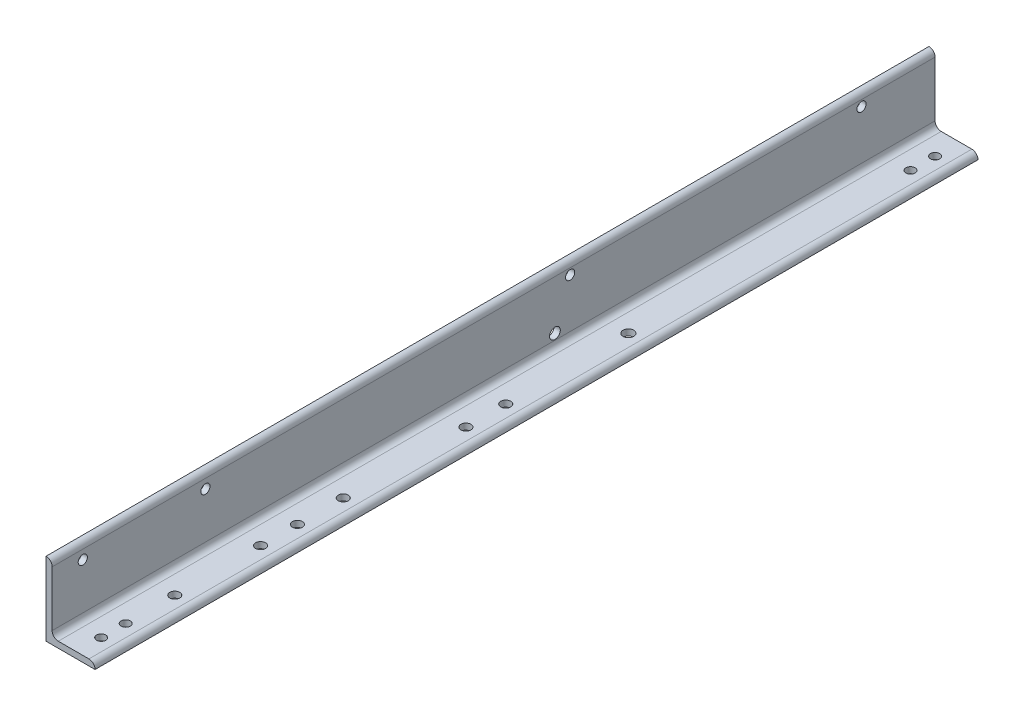
ISO-10303-21;
HEADER;
FILE_DESCRIPTION(('STEP AP214'),'2;1');
FILE_NAME('part.step','',(''),(''),'','','');
FILE_SCHEMA(('AUTOMOTIVE_DESIGN { 1 0 10303 214 1 1 1 1 }'));
ENDSEC;
DATA;
#1=APPLICATION_CONTEXT('core data for automotive mechanical design processes');
#2=APPLICATION_PROTOCOL_DEFINITION('international standard','automotive_design',2000,#1);
#3=PRODUCT_CONTEXT('',#1,'mechanical');
#4=PRODUCT('Part','Part','',(#3));
#5=PRODUCT_RELATED_PRODUCT_CATEGORY('part','',(#4));
#6=PRODUCT_DEFINITION_FORMATION('','',#4);
#7=PRODUCT_DEFINITION_CONTEXT('part definition',#1,'design');
#8=PRODUCT_DEFINITION('design','',#6,#7);
#9=PRODUCT_DEFINITION_SHAPE('','',#8);
#10=(LENGTH_UNIT() NAMED_UNIT(*) SI_UNIT(.MILLI.,.METRE.));
#11=(NAMED_UNIT(*) PLANE_ANGLE_UNIT() SI_UNIT($,.RADIAN.));
#12=(NAMED_UNIT(*) SI_UNIT($,.STERADIAN.) SOLID_ANGLE_UNIT());
#13=UNCERTAINTY_MEASURE_WITH_UNIT(LENGTH_MEASURE(1.E-05),#10,'distance_accuracy_value','');
#14=(GEOMETRIC_REPRESENTATION_CONTEXT(3) GLOBAL_UNCERTAINTY_ASSIGNED_CONTEXT((#13)) GLOBAL_UNIT_ASSIGNED_CONTEXT((#10,
#11,#12)) REPRESENTATION_CONTEXT('',''));
#15=CARTESIAN_POINT('',(0.,0.,0.));
#16=DIRECTION('',(0.,0.,1.));
#17=DIRECTION('',(1.,0.,0.));
#18=AXIS2_PLACEMENT_3D('',#15,#16,#17);
#19=CARTESIAN_POINT('',(101.6,0.,914.4));
#20=DIRECTION('',(0.,1.,0.));
#21=DIRECTION('',(-1.,0.,0.));
#22=AXIS2_PLACEMENT_3D('',#19,#20,#21);
#23=PLANE('',#22);
#24=CARTESIAN_POINT('',(63.5,0.,812.8));
#25=DIRECTION('',(0.,1.,0.));
#26=DIRECTION('',(-1.,0.,0.));
#27=AXIS2_PLACEMENT_3D('',#24,#25,#26);
#28=CIRCLE('',#27,9.525);
#29=CARTESIAN_POINT('',(53.975,0.,812.8));
#30=VERTEX_POINT('',#29);
#31=EDGE_CURVE('E253',#30,#30,#28,.F.);
#32=ORIENTED_EDGE('',*,*,#31,.F.);
#33=EDGE_LOOP('',(#32));
#34=FACE_BOUND('',#33,.T.);
#35=CARTESIAN_POINT('',(63.5,0.,-812.8));
#36=DIRECTION('',(0.,1.,0.));
#37=DIRECTION('',(-1.,0.,0.));
#38=AXIS2_PLACEMENT_3D('',#35,#36,#37);
#39=CIRCLE('',#38,9.525);
#40=CARTESIAN_POINT('',(53.975,0.,-812.8));
#41=VERTEX_POINT('',#40);
#42=EDGE_CURVE('E247',#41,#41,#39,.F.);
#43=ORIENTED_EDGE('',*,*,#42,.F.);
#44=EDGE_LOOP('',(#43));
#45=FACE_BOUND('',#44,.T.);
#46=CARTESIAN_POINT('',(63.5,0.,362.204));
#47=DIRECTION('',(0.,1.,0.));
#48=DIRECTION('',(-1.,0.,0.));
#49=AXIS2_PLACEMENT_3D('',#46,#47,#48);
#50=CIRCLE('',#49,10.31875);
#51=CARTESIAN_POINT('',(53.18125,0.,362.204));
#52=VERTEX_POINT('',#51);
#53=EDGE_CURVE('E241',#52,#52,#50,.F.);
#54=ORIENTED_EDGE('',*,*,#53,.F.);
#55=EDGE_LOOP('',(#54));
#56=FACE_BOUND('',#55,.T.);
#57=CARTESIAN_POINT('',(63.5,0.,-228.346));
#58=DIRECTION('',(0.,1.,0.));
#59=DIRECTION('',(-1.,0.,0.));
#60=AXIS2_PLACEMENT_3D('',#57,#58,#59);
#61=CIRCLE('',#60,11.1125);
#62=CARTESIAN_POINT('',(52.3875,0.,-228.346));
#63=VERTEX_POINT('',#62);
#64=EDGE_CURVE('E235',#63,#63,#61,.F.);
#65=ORIENTED_EDGE('',*,*,#64,.F.);
#66=EDGE_LOOP('',(#65));
#67=FACE_BOUND('',#66,.T.);
#68=CARTESIAN_POINT('',(63.5,0.,25.654));
#69=DIRECTION('',(0.,1.,0.));
#70=DIRECTION('',(-1.,0.,0.));
#71=AXIS2_PLACEMENT_3D('',#68,#69,#70);
#72=CIRCLE('',#71,10.31875);
#73=CARTESIAN_POINT('',(53.18125,0.,25.654));
#74=VERTEX_POINT('',#73);
#75=EDGE_CURVE('E229',#74,#74,#72,.F.);
#76=ORIENTED_EDGE('',*,*,#75,.F.);
#77=EDGE_LOOP('',(#76));
#78=FACE_BOUND('',#77,.T.);
#79=CARTESIAN_POINT('',(63.5,0.,533.4));
#80=DIRECTION('',(0.,1.,0.));
#81=DIRECTION('',(-1.,0.,0.));
#82=AXIS2_PLACEMENT_3D('',#79,#80,#81);
#83=CIRCLE('',#82,10.31875);
#84=CARTESIAN_POINT('',(53.18125,0.,533.4));
#85=VERTEX_POINT('',#84);
#86=EDGE_CURVE('E223',#85,#85,#83,.F.);
#87=ORIENTED_EDGE('',*,*,#86,.F.);
#88=EDGE_LOOP('',(#87));
#89=FACE_BOUND('',#88,.T.);
#90=CARTESIAN_POINT('',(63.5,0.,108.204));
#91=DIRECTION('',(0.,1.,0.));
#92=DIRECTION('',(-1.,0.,0.));
#93=AXIS2_PLACEMENT_3D('',#90,#91,#92);
#94=CIRCLE('',#93,10.31875);
#95=CARTESIAN_POINT('',(53.18125,0.,108.204));
#96=VERTEX_POINT('',#95);
#97=EDGE_CURVE('E217',#96,#96,#94,.F.);
#98=ORIENTED_EDGE('',*,*,#97,.F.);
#99=EDGE_LOOP('',(#98));
#100=FACE_BOUND('',#99,.T.);
#101=CARTESIAN_POINT('',(63.5,0.,457.2));
#102=DIRECTION('',(0.,1.,0.));
#103=DIRECTION('',(-1.,0.,0.));
#104=AXIS2_PLACEMENT_3D('',#101,#102,#103);
#105=CIRCLE('',#104,10.31875);
#106=CARTESIAN_POINT('',(53.18125,0.,457.2));
#107=VERTEX_POINT('',#106);
#108=EDGE_CURVE('E211',#107,#107,#105,.F.);
#109=ORIENTED_EDGE('',*,*,#108,.F.);
#110=EDGE_LOOP('',(#109));
#111=FACE_BOUND('',#110,.T.);
#112=CARTESIAN_POINT('',(63.5,0.,711.2));
#113=DIRECTION('',(0.,1.,0.));
#114=DIRECTION('',(-1.,0.,0.));
#115=AXIS2_PLACEMENT_3D('',#112,#113,#114);
#116=CIRCLE('',#115,10.31875);
#117=CARTESIAN_POINT('',(53.18125,0.,711.2));
#118=VERTEX_POINT('',#117);
#119=EDGE_CURVE('E205',#118,#118,#116,.F.);
#120=ORIENTED_EDGE('',*,*,#119,.F.);
#121=EDGE_LOOP('',(#120));
#122=FACE_BOUND('',#121,.T.);
#123=CARTESIAN_POINT('',(63.5,0.,-863.6));
#124=DIRECTION('',(0.,1.,0.));
#125=DIRECTION('',(-1.,0.,0.));
#126=AXIS2_PLACEMENT_3D('',#123,#124,#125);
#127=CIRCLE('',#126,9.525);
#128=CARTESIAN_POINT('',(53.975,0.,-863.6));
#129=VERTEX_POINT('',#128);
#130=EDGE_CURVE('E199',#129,#129,#127,.F.);
#131=ORIENTED_EDGE('',*,*,#130,.F.);
#132=EDGE_LOOP('',(#131));
#133=FACE_BOUND('',#132,.T.);
#134=CARTESIAN_POINT('',(63.5,0.,863.6));
#135=DIRECTION('',(0.,1.,0.));
#136=DIRECTION('',(-1.,0.,0.));
#137=AXIS2_PLACEMENT_3D('',#134,#135,#136);
#138=CIRCLE('',#137,9.525);
#139=CARTESIAN_POINT('',(53.975,0.,863.6));
#140=VERTEX_POINT('',#139);
#141=EDGE_CURVE('E140',#140,#140,#138,.F.);
#142=ORIENTED_EDGE('',*,*,#141,.F.);
#143=EDGE_LOOP('',(#142));
#144=FACE_BOUND('',#143,.T.);
#145=DIRECTION('',(1.,0.,0.));
#146=VECTOR('',#145,1.);
#147=CARTESIAN_POINT('',(101.6,0.,-914.4));
#148=LINE('',#147,#146);
#149=CARTESIAN_POINT('',(0.,0.,-914.4));
#150=VERTEX_POINT('',#149);
#151=CARTESIAN_POINT('',(101.6,0.,-914.4));
#152=VERTEX_POINT('',#151);
#153=EDGE_CURVE('E136',#150,#152,#148,.T.);
#154=ORIENTED_EDGE('',*,*,#153,.T.);
#155=DIRECTION('',(0.,0.,-1.));
#156=VECTOR('',#155,1.);
#157=CARTESIAN_POINT('',(101.6,0.,914.4));
#158=LINE('',#157,#156);
#159=CARTESIAN_POINT('',(101.6,0.,914.4));
#160=VERTEX_POINT('',#159);
#161=EDGE_CURVE('E11',#160,#152,#158,.T.);
#162=ORIENTED_EDGE('',*,*,#161,.F.);
#163=DIRECTION('',(1.,0.,0.));
#164=VECTOR('',#163,1.);
#165=CARTESIAN_POINT('',(101.6,0.,914.4));
#166=LINE('',#165,#164);
#167=CARTESIAN_POINT('',(0.,0.,914.4));
#168=VERTEX_POINT('',#167);
#169=EDGE_CURVE('E153',#168,#160,#166,.T.);
#170=ORIENTED_EDGE('',*,*,#169,.F.);
#171=DIRECTION('',(0.,0.,-1.));
#172=VECTOR('',#171,1.);
#173=CARTESIAN_POINT('',(0.,0.,914.4));
#174=LINE('',#173,#172);
#175=EDGE_CURVE('E132',#168,#150,#174,.T.);
#176=ORIENTED_EDGE('',*,*,#175,.T.);
#177=EDGE_LOOP('',(#154,#162,#170,#176));
#178=FACE_BOUND('',#177,.T.);
#179=ADVANCED_FACE('F34',(#34,#45,#56,#67,#78,#89,#100,#111,#122,#133,#144,#178),#23,.F.);
#180=CARTESIAN_POINT('',(101.6,0.00508000000000453,914.4));
#181=DIRECTION('',(-1.,0.,0.));
#182=DIRECTION('',(0.,0.,1.));
#183=AXIS2_PLACEMENT_3D('',#180,#181,#182);
#184=PLANE('',#183);
#185=DIRECTION('',(0.,1.,0.));
#186=VECTOR('',#185,1.);
#187=CARTESIAN_POINT('',(101.6,0.00508000000000453,-914.4));
#188=LINE('',#187,#186);
#189=CARTESIAN_POINT('',(101.6,0.00508000000000453,-914.4));
#190=VERTEX_POINT('',#189);
#191=EDGE_CURVE('E139',#152,#190,#188,.T.);
#192=ORIENTED_EDGE('',*,*,#191,.T.);
#193=DIRECTION('',(0.,0.,-1.));
#194=VECTOR('',#193,1.);
#195=CARTESIAN_POINT('',(101.6,0.00508000000000453,914.4));
#196=LINE('',#195,#194);
#197=CARTESIAN_POINT('',(101.6,0.00508000000000453,914.4));
#198=VERTEX_POINT('',#197);
#199=EDGE_CURVE('E42',#198,#190,#196,.T.);
#200=ORIENTED_EDGE('',*,*,#199,.F.);
#201=DIRECTION('',(0.,1.,0.));
#202=VECTOR('',#201,1.);
#203=CARTESIAN_POINT('',(101.6,0.00508000000000453,914.4));
#204=LINE('',#203,#202);
#205=EDGE_CURVE('E96',#160,#198,#204,.T.);
#206=ORIENTED_EDGE('',*,*,#205,.F.);
#207=ORIENTED_EDGE('',*,*,#161,.T.);
#208=EDGE_LOOP('',(#192,#200,#206,#207));
#209=FACE_BOUND('',#208,.T.);
#210=ADVANCED_FACE('F322',(#209),#184,.F.);
#211=CARTESIAN_POINT('',(88.90508,0.00508000000000453,914.4));
#212=DIRECTION('',(0.,0.,-1.));
#213=DIRECTION('',(-1.,0.,0.));
#214=AXIS2_PLACEMENT_3D('',#211,#212,#213);
#215=CYLINDRICAL_SURFACE('',#214,12.69492);
#216=CARTESIAN_POINT('',(88.90508,0.00508000000000453,-914.4));
#217=DIRECTION('',(0.,0.,1.));
#218=DIRECTION('',(1.,0.,0.));
#219=AXIS2_PLACEMENT_3D('',#216,#217,#218);
#220=CIRCLE('',#219,12.69492);
#221=CARTESIAN_POINT('',(88.90508,12.7,-914.4));
#222=VERTEX_POINT('',#221);
#223=EDGE_CURVE('E142',#190,#222,#220,.T.);
#224=ORIENTED_EDGE('',*,*,#223,.T.);
#225=DIRECTION('',(0.,0.,-1.));
#226=VECTOR('',#225,1.);
#227=CARTESIAN_POINT('',(88.90508,12.7,914.4));
#228=LINE('',#227,#226);
#229=CARTESIAN_POINT('',(88.90508,12.7,914.4));
#230=VERTEX_POINT('',#229);
#231=EDGE_CURVE('E163',#230,#222,#228,.T.);
#232=ORIENTED_EDGE('',*,*,#231,.F.);
#233=CARTESIAN_POINT('',(88.90508,0.00508000000000453,914.4));
#234=DIRECTION('',(0.,0.,1.));
#235=DIRECTION('',(1.,0.,0.));
#236=AXIS2_PLACEMENT_3D('',#233,#234,#235);
#237=CIRCLE('',#236,12.69492);
#238=EDGE_CURVE('E171',#198,#230,#237,.T.);
#239=ORIENTED_EDGE('',*,*,#238,.F.);
#240=ORIENTED_EDGE('',*,*,#199,.T.);
#241=EDGE_LOOP('',(#224,#232,#239,#240));
#242=FACE_BOUND('',#241,.T.);
#243=ADVANCED_FACE('F169',(#242),#215,.T.);
#244=CARTESIAN_POINT('',(25.4,12.7,914.4));
#245=DIRECTION('',(0.,-1.,0.));
#246=DIRECTION('',(0.,0.,-1.));
#247=AXIS2_PLACEMENT_3D('',#244,#245,#246);
#248=PLANE('',#247);
#249=CARTESIAN_POINT('',(63.5,12.7,812.8));
#250=DIRECTION('',(0.,1.,0.));
#251=DIRECTION('',(-1.,0.,0.));
#252=AXIS2_PLACEMENT_3D('',#249,#250,#251);
#253=CIRCLE('',#252,9.525);
#254=CARTESIAN_POINT('',(53.975,12.7,812.8));
#255=VERTEX_POINT('',#254);
#256=EDGE_CURVE('E256',#255,#255,#253,.T.);
#257=ORIENTED_EDGE('',*,*,#256,.F.);
#258=EDGE_LOOP('',(#257));
#259=FACE_BOUND('',#258,.T.);
#260=CARTESIAN_POINT('',(63.5,12.7,-812.8));
#261=DIRECTION('',(0.,1.,0.));
#262=DIRECTION('',(-1.,0.,0.));
#263=AXIS2_PLACEMENT_3D('',#260,#261,#262);
#264=CIRCLE('',#263,9.525);
#265=CARTESIAN_POINT('',(53.975,12.7,-812.8));
#266=VERTEX_POINT('',#265);
#267=EDGE_CURVE('E250',#266,#266,#264,.T.);
#268=ORIENTED_EDGE('',*,*,#267,.F.);
#269=EDGE_LOOP('',(#268));
#270=FACE_BOUND('',#269,.T.);
#271=CARTESIAN_POINT('',(63.5,12.7,362.204));
#272=DIRECTION('',(0.,1.,0.));
#273=DIRECTION('',(-1.,0.,0.));
#274=AXIS2_PLACEMENT_3D('',#271,#272,#273);
#275=CIRCLE('',#274,10.31875);
#276=CARTESIAN_POINT('',(53.18125,12.7,362.204));
#277=VERTEX_POINT('',#276);
#278=EDGE_CURVE('E244',#277,#277,#275,.T.);
#279=ORIENTED_EDGE('',*,*,#278,.F.);
#280=EDGE_LOOP('',(#279));
#281=FACE_BOUND('',#280,.T.);
#282=CARTESIAN_POINT('',(63.5,12.7,-228.346));
#283=DIRECTION('',(0.,1.,0.));
#284=DIRECTION('',(-1.,0.,0.));
#285=AXIS2_PLACEMENT_3D('',#282,#283,#284);
#286=CIRCLE('',#285,11.1125);
#287=CARTESIAN_POINT('',(52.3875,12.7,-228.346));
#288=VERTEX_POINT('',#287);
#289=EDGE_CURVE('E238',#288,#288,#286,.T.);
#290=ORIENTED_EDGE('',*,*,#289,.F.);
#291=EDGE_LOOP('',(#290));
#292=FACE_BOUND('',#291,.T.);
#293=CARTESIAN_POINT('',(63.5,12.7,25.654));
#294=DIRECTION('',(0.,1.,0.));
#295=DIRECTION('',(-1.,0.,0.));
#296=AXIS2_PLACEMENT_3D('',#293,#294,#295);
#297=CIRCLE('',#296,10.31875);
#298=CARTESIAN_POINT('',(53.18125,12.7,25.654));
#299=VERTEX_POINT('',#298);
#300=EDGE_CURVE('E232',#299,#299,#297,.T.);
#301=ORIENTED_EDGE('',*,*,#300,.F.);
#302=EDGE_LOOP('',(#301));
#303=FACE_BOUND('',#302,.T.);
#304=CARTESIAN_POINT('',(63.5,12.7,533.4));
#305=DIRECTION('',(0.,1.,0.));
#306=DIRECTION('',(-1.,0.,0.));
#307=AXIS2_PLACEMENT_3D('',#304,#305,#306);
#308=CIRCLE('',#307,10.31875);
#309=CARTESIAN_POINT('',(53.18125,12.7,533.4));
#310=VERTEX_POINT('',#309);
#311=EDGE_CURVE('E226',#310,#310,#308,.T.);
#312=ORIENTED_EDGE('',*,*,#311,.F.);
#313=EDGE_LOOP('',(#312));
#314=FACE_BOUND('',#313,.T.);
#315=CARTESIAN_POINT('',(63.5,12.7,108.204));
#316=DIRECTION('',(0.,1.,0.));
#317=DIRECTION('',(-1.,0.,0.));
#318=AXIS2_PLACEMENT_3D('',#315,#316,#317);
#319=CIRCLE('',#318,10.31875);
#320=CARTESIAN_POINT('',(53.18125,12.7,108.204));
#321=VERTEX_POINT('',#320);
#322=EDGE_CURVE('E220',#321,#321,#319,.T.);
#323=ORIENTED_EDGE('',*,*,#322,.F.);
#324=EDGE_LOOP('',(#323));
#325=FACE_BOUND('',#324,.T.);
#326=CARTESIAN_POINT('',(63.5,12.7,457.2));
#327=DIRECTION('',(0.,1.,0.));
#328=DIRECTION('',(-1.,0.,0.));
#329=AXIS2_PLACEMENT_3D('',#326,#327,#328);
#330=CIRCLE('',#329,10.31875);
#331=CARTESIAN_POINT('',(53.18125,12.7,457.2));
#332=VERTEX_POINT('',#331);
#333=EDGE_CURVE('E214',#332,#332,#330,.T.);
#334=ORIENTED_EDGE('',*,*,#333,.F.);
#335=EDGE_LOOP('',(#334));
#336=FACE_BOUND('',#335,.T.);
#337=CARTESIAN_POINT('',(63.5,12.7,711.2));
#338=DIRECTION('',(0.,1.,0.));
#339=DIRECTION('',(-1.,0.,0.));
#340=AXIS2_PLACEMENT_3D('',#337,#338,#339);
#341=CIRCLE('',#340,10.31875);
#342=CARTESIAN_POINT('',(53.18125,12.7,711.2));
#343=VERTEX_POINT('',#342);
#344=EDGE_CURVE('E208',#343,#343,#341,.T.);
#345=ORIENTED_EDGE('',*,*,#344,.F.);
#346=EDGE_LOOP('',(#345));
#347=FACE_BOUND('',#346,.T.);
#348=CARTESIAN_POINT('',(63.5,12.7,-863.6));
#349=DIRECTION('',(0.,1.,0.));
#350=DIRECTION('',(-1.,0.,0.));
#351=AXIS2_PLACEMENT_3D('',#348,#349,#350);
#352=CIRCLE('',#351,9.525);
#353=CARTESIAN_POINT('',(53.975,12.7,-863.6));
#354=VERTEX_POINT('',#353);
#355=EDGE_CURVE('E202',#354,#354,#352,.T.);
#356=ORIENTED_EDGE('',*,*,#355,.F.);
#357=EDGE_LOOP('',(#356));
#358=FACE_BOUND('',#357,.T.);
#359=CARTESIAN_POINT('',(63.5,12.7,863.6));
#360=DIRECTION('',(0.,1.,0.));
#361=DIRECTION('',(-1.,0.,0.));
#362=AXIS2_PLACEMENT_3D('',#359,#360,#361);
#363=CIRCLE('',#362,9.525);
#364=CARTESIAN_POINT('',(53.975,12.7,863.6));
#365=VERTEX_POINT('',#364);
#366=EDGE_CURVE('E196',#365,#365,#363,.T.);
#367=ORIENTED_EDGE('',*,*,#366,.F.);
#368=EDGE_LOOP('',(#367));
#369=FACE_BOUND('',#368,.T.);
#370=DIRECTION('',(-1.,0.,0.));
#371=VECTOR('',#370,1.);
#372=CARTESIAN_POINT('',(25.4,12.7,-914.4));
#373=LINE('',#372,#371);
#374=CARTESIAN_POINT('',(25.4,12.7,-914.4));
#375=VERTEX_POINT('',#374);
#376=EDGE_CURVE('E144',#222,#375,#373,.T.);
#377=ORIENTED_EDGE('',*,*,#376,.T.);
#378=DIRECTION('',(0.,0.,-1.));
#379=VECTOR('',#378,1.);
#380=CARTESIAN_POINT('',(25.4,12.7,914.4));
#381=LINE('',#380,#379);
#382=CARTESIAN_POINT('',(25.4,12.7,914.4));
#383=VERTEX_POINT('',#382);
#384=EDGE_CURVE('E160',#383,#375,#381,.T.);
#385=ORIENTED_EDGE('',*,*,#384,.F.);
#386=DIRECTION('',(-1.,0.,0.));
#387=VECTOR('',#386,1.);
#388=CARTESIAN_POINT('',(25.4,12.7,914.4));
#389=LINE('',#388,#387);
#390=EDGE_CURVE('E187',#230,#383,#389,.T.);
#391=ORIENTED_EDGE('',*,*,#390,.F.);
#392=ORIENTED_EDGE('',*,*,#231,.T.);
#393=EDGE_LOOP('',(#377,#385,#391,#392));
#394=FACE_BOUND('',#393,.T.);
#395=ADVANCED_FACE('F180',(#259,#270,#281,#292,#303,#314,#325,#336,#347,#358,#369,#394),#248,.F.);
#396=CARTESIAN_POINT('',(25.4,25.4,914.4));
#397=DIRECTION('',(0.,0.,-1.));
#398=DIRECTION('',(-1.,0.,0.));
#399=AXIS2_PLACEMENT_3D('',#396,#397,#398);
#400=CYLINDRICAL_SURFACE('',#399,12.7);
#401=CARTESIAN_POINT('',(25.4,25.4,-914.4));
#402=DIRECTION('',(0.,0.,-1.));
#403=DIRECTION('',(-1.,0.,0.));
#404=AXIS2_PLACEMENT_3D('',#401,#402,#403);
#405=CIRCLE('',#404,12.7);
#406=CARTESIAN_POINT('',(12.7,25.4,-914.4));
#407=VERTEX_POINT('',#406);
#408=EDGE_CURVE('E146',#375,#407,#405,.T.);
#409=ORIENTED_EDGE('',*,*,#408,.T.);
#410=DIRECTION('',(0.,0.,-1.));
#411=VECTOR('',#410,1.);
#412=CARTESIAN_POINT('',(12.7,25.4,914.4));
#413=LINE('',#412,#411);
#414=CARTESIAN_POINT('',(12.7,25.4,914.4));
#415=VERTEX_POINT('',#414);
#416=EDGE_CURVE('E157',#415,#407,#413,.T.);
#417=ORIENTED_EDGE('',*,*,#416,.F.);
#418=CARTESIAN_POINT('',(25.4,25.4,914.4));
#419=DIRECTION('',(0.,0.,-1.));
#420=DIRECTION('',(-1.,0.,0.));
#421=AXIS2_PLACEMENT_3D('',#418,#419,#420);
#422=CIRCLE('',#421,12.7);
#423=EDGE_CURVE('E186',#383,#415,#422,.T.);
#424=ORIENTED_EDGE('',*,*,#423,.F.);
#425=ORIENTED_EDGE('',*,*,#384,.T.);
#426=EDGE_LOOP('',(#409,#417,#424,#425));
#427=FACE_BOUND('',#426,.T.);
#428=ADVANCED_FACE('F184',(#427),#400,.F.);
#429=CARTESIAN_POINT('',(12.7,139.70508,914.4));
#430=DIRECTION('',(-1.,0.,0.));
#431=DIRECTION('',(0.,-1.,0.));
#432=AXIS2_PLACEMENT_3D('',#429,#430,#431);
#433=PLANE('',#432);
#434=CARTESIAN_POINT('',(12.7,38.1,-127.));
#435=DIRECTION('',(-1.,0.,0.));
#436=DIRECTION('',(0.,-1.,0.));
#437=AXIS2_PLACEMENT_3D('',#434,#435,#436);
#438=CIRCLE('',#437,11.1125);
#439=CARTESIAN_POINT('',(12.7,26.9875,-127.));
#440=VERTEX_POINT('',#439);
#441=EDGE_CURVE('E283',#440,#440,#438,.T.);
#442=ORIENTED_EDGE('',*,*,#441,.T.);
#443=EDGE_LOOP('',(#442));
#444=FACE_BOUND('',#443,.T.);
#445=CARTESIAN_POINT('',(12.7,127.,-762.));
#446=DIRECTION('',(1.,0.,0.));
#447=DIRECTION('',(0.,1.,0.));
#448=AXIS2_PLACEMENT_3D('',#445,#446,#447);
#449=CIRCLE('',#448,9.52500000000002);
#450=CARTESIAN_POINT('',(12.7,136.525,-762.));
#451=VERTEX_POINT('',#450);
#452=EDGE_CURVE('E280',#451,#451,#449,.T.);
#453=ORIENTED_EDGE('',*,*,#452,.F.);
#454=EDGE_LOOP('',(#453));
#455=FACE_BOUND('',#454,.T.);
#456=CARTESIAN_POINT('',(12.7,127.,-158.496));
#457=DIRECTION('',(1.,0.,0.));
#458=DIRECTION('',(0.,1.,0.));
#459=AXIS2_PLACEMENT_3D('',#456,#457,#458);
#460=CIRCLE('',#459,9.52499999999999);
#461=CARTESIAN_POINT('',(12.7,136.525,-158.496));
#462=VERTEX_POINT('',#461);
#463=EDGE_CURVE('E274',#462,#462,#460,.T.);
#464=ORIENTED_EDGE('',*,*,#463,.F.);
#465=EDGE_LOOP('',(#464));
#466=FACE_BOUND('',#465,.T.);
#467=CARTESIAN_POINT('',(12.7,120.65,596.9));
#468=DIRECTION('',(1.,0.,0.));
#469=DIRECTION('',(0.,1.,0.));
#470=AXIS2_PLACEMENT_3D('',#467,#468,#469);
#471=CIRCLE('',#470,9.52500000000002);
#472=CARTESIAN_POINT('',(12.7,130.175,596.9));
#473=VERTEX_POINT('',#472);
#474=EDGE_CURVE('E268',#473,#473,#471,.T.);
#475=ORIENTED_EDGE('',*,*,#474,.F.);
#476=EDGE_LOOP('',(#475));
#477=FACE_BOUND('',#476,.T.);
#478=CARTESIAN_POINT('',(12.7,120.65,850.9));
#479=DIRECTION('',(1.,0.,0.));
#480=DIRECTION('',(0.,1.,0.));
#481=AXIS2_PLACEMENT_3D('',#478,#479,#480);
#482=CIRCLE('',#481,9.52500000000002);
#483=CARTESIAN_POINT('',(12.7,130.175,850.9));
#484=VERTEX_POINT('',#483);
#485=EDGE_CURVE('E262',#484,#484,#482,.T.);
#486=ORIENTED_EDGE('',*,*,#485,.F.);
#487=EDGE_LOOP('',(#486));
#488=FACE_BOUND('',#487,.T.);
#489=DIRECTION('',(0.,1.,0.));
#490=VECTOR('',#489,1.);
#491=CARTESIAN_POINT('',(12.7,139.70508,-914.4));
#492=LINE('',#491,#490);
#493=CARTESIAN_POINT('',(12.7,139.70508,-914.4));
#494=VERTEX_POINT('',#493);
#495=EDGE_CURVE('E148',#407,#494,#492,.T.);
#496=ORIENTED_EDGE('',*,*,#495,.T.);
#497=DIRECTION('',(0.,0.,-1.));
#498=VECTOR('',#497,1.);
#499=CARTESIAN_POINT('',(12.7,139.70508,914.4));
#500=LINE('',#499,#498);
#501=CARTESIAN_POINT('',(12.7,139.70508,914.4));
#502=VERTEX_POINT('',#501);
#503=EDGE_CURVE('E127',#502,#494,#500,.T.);
#504=ORIENTED_EDGE('',*,*,#503,.F.);
#505=DIRECTION('',(0.,1.,0.));
#506=VECTOR('',#505,1.);
#507=CARTESIAN_POINT('',(12.7,139.70508,914.4));
#508=LINE('',#507,#506);
#509=EDGE_CURVE('E118',#415,#502,#508,.T.);
#510=ORIENTED_EDGE('',*,*,#509,.F.);
#511=ORIENTED_EDGE('',*,*,#416,.T.);
#512=EDGE_LOOP('',(#496,#504,#510,#511));
#513=FACE_BOUND('',#512,.T.);
#514=ADVANCED_FACE('F352',(#444,#455,#466,#477,#488,#513),#433,.F.);
#515=CARTESIAN_POINT('',(0.00508000000000078,139.70508,914.4));
#516=DIRECTION('',(0.,0.,-1.));
#517=DIRECTION('',(-1.,0.,0.));
#518=AXIS2_PLACEMENT_3D('',#515,#516,#517);
#519=CYLINDRICAL_SURFACE('',#518,12.69492);
#520=CARTESIAN_POINT('',(0.00508000000000078,139.70508,-914.4));
#521=DIRECTION('',(0.,0.,1.));
#522=DIRECTION('',(-1.,0.,0.));
#523=AXIS2_PLACEMENT_3D('',#520,#521,#522);
#524=CIRCLE('',#523,12.69492);
#525=CARTESIAN_POINT('',(0.00508,152.4,-914.4));
#526=VERTEX_POINT('',#525);
#527=EDGE_CURVE('E126',#494,#526,#524,.T.);
#528=ORIENTED_EDGE('',*,*,#527,.T.);
#529=DIRECTION('',(0.,0.,-1.));
#530=VECTOR('',#529,1.);
#531=CARTESIAN_POINT('',(0.00508,152.4,914.4));
#532=LINE('',#531,#530);
#533=CARTESIAN_POINT('',(0.00508,152.4,914.4));
#534=VERTEX_POINT('',#533);
#535=EDGE_CURVE('E123',#534,#526,#532,.T.);
#536=ORIENTED_EDGE('',*,*,#535,.F.);
#537=CARTESIAN_POINT('',(0.00508000000000078,139.70508,914.4));
#538=DIRECTION('',(0.,0.,1.));
#539=DIRECTION('',(-1.,0.,0.));
#540=AXIS2_PLACEMENT_3D('',#537,#538,#539);
#541=CIRCLE('',#540,12.69492);
#542=EDGE_CURVE('E112',#502,#534,#541,.T.);
#543=ORIENTED_EDGE('',*,*,#542,.F.);
#544=ORIENTED_EDGE('',*,*,#503,.T.);
#545=EDGE_LOOP('',(#528,#536,#543,#544));
#546=FACE_BOUND('',#545,.T.);
#547=ADVANCED_FACE('F124',(#546),#519,.T.);
#548=CARTESIAN_POINT('',(0.,152.4,914.4));
#549=DIRECTION('',(0.,-1.,0.));
#550=DIRECTION('',(0.,0.,-1.));
#551=AXIS2_PLACEMENT_3D('',#548,#549,#550);
#552=PLANE('',#551);
#553=DIRECTION('',(-1.,0.,0.));
#554=VECTOR('',#553,1.);
#555=CARTESIAN_POINT('',(0.,152.4,-914.4));
#556=LINE('',#555,#554);
#557=CARTESIAN_POINT('',(0.,152.4,-914.4));
#558=VERTEX_POINT('',#557);
#559=EDGE_CURVE('E82',#526,#558,#556,.T.);
#560=ORIENTED_EDGE('',*,*,#559,.T.);
#561=DIRECTION('',(0.,0.,-1.));
#562=VECTOR('',#561,1.);
#563=CARTESIAN_POINT('',(0.,152.4,914.4));
#564=LINE('',#563,#562);
#565=CARTESIAN_POINT('',(0.,152.4,914.4));
#566=VERTEX_POINT('',#565);
#567=EDGE_CURVE('E128',#566,#558,#564,.T.);
#568=ORIENTED_EDGE('',*,*,#567,.F.);
#569=DIRECTION('',(-1.,0.,0.));
#570=VECTOR('',#569,1.);
#571=CARTESIAN_POINT('',(0.,152.4,914.4));
#572=LINE('',#571,#570);
#573=EDGE_CURVE('E116',#534,#566,#572,.T.);
#574=ORIENTED_EDGE('',*,*,#573,.F.);
#575=ORIENTED_EDGE('',*,*,#535,.T.);
#576=EDGE_LOOP('',(#560,#568,#574,#575));
#577=FACE_BOUND('',#576,.T.);
#578=ADVANCED_FACE('F130',(#577),#552,.F.);
#579=CARTESIAN_POINT('',(0.,0.,914.4));
#580=DIRECTION('',(1.,0.,0.));
#581=DIRECTION('',(0.,0.,-1.));
#582=AXIS2_PLACEMENT_3D('',#579,#580,#581);
#583=PLANE('',#582);
#584=CARTESIAN_POINT('',(0.,38.1,-127.));
#585=DIRECTION('',(-1.,0.,0.));
#586=DIRECTION('',(0.,0.,1.));
#587=AXIS2_PLACEMENT_3D('',#584,#585,#586);
#588=CIRCLE('',#587,11.1125);
#589=CARTESIAN_POINT('',(0.,38.1,-115.8875));
#590=VERTEX_POINT('',#589);
#591=EDGE_CURVE('E286',#590,#590,#588,.T.);
#592=ORIENTED_EDGE('',*,*,#591,.F.);
#593=EDGE_LOOP('',(#592));
#594=FACE_BOUND('',#593,.T.);
#595=CARTESIAN_POINT('',(0.,127.,-762.));
#596=DIRECTION('',(1.,0.,0.));
#597=DIRECTION('',(0.,0.,-1.));
#598=AXIS2_PLACEMENT_3D('',#595,#596,#597);
#599=CIRCLE('',#598,9.52500000000002);
#600=CARTESIAN_POINT('',(0.,127.,-771.525));
#601=VERTEX_POINT('',#600);
#602=EDGE_CURVE('E277',#601,#601,#599,.F.);
#603=ORIENTED_EDGE('',*,*,#602,.F.);
#604=EDGE_LOOP('',(#603));
#605=FACE_BOUND('',#604,.T.);
#606=CARTESIAN_POINT('',(0.,127.,-158.496));
#607=DIRECTION('',(1.,0.,0.));
#608=DIRECTION('',(0.,0.,-1.));
#609=AXIS2_PLACEMENT_3D('',#606,#607,#608);
#610=CIRCLE('',#609,9.52499999999999);
#611=CARTESIAN_POINT('',(0.,127.,-168.021));
#612=VERTEX_POINT('',#611);
#613=EDGE_CURVE('E271',#612,#612,#610,.F.);
#614=ORIENTED_EDGE('',*,*,#613,.F.);
#615=EDGE_LOOP('',(#614));
#616=FACE_BOUND('',#615,.T.);
#617=CARTESIAN_POINT('',(0.,120.65,596.9));
#618=DIRECTION('',(1.,0.,0.));
#619=DIRECTION('',(0.,0.,-1.));
#620=AXIS2_PLACEMENT_3D('',#617,#618,#619);
#621=CIRCLE('',#620,9.52500000000002);
#622=CARTESIAN_POINT('',(0.,120.65,587.375));
#623=VERTEX_POINT('',#622);
#624=EDGE_CURVE('E265',#623,#623,#621,.F.);
#625=ORIENTED_EDGE('',*,*,#624,.F.);
#626=EDGE_LOOP('',(#625));
#627=FACE_BOUND('',#626,.T.);
#628=CARTESIAN_POINT('',(0.,120.65,850.9));
#629=DIRECTION('',(1.,0.,0.));
#630=DIRECTION('',(0.,0.,-1.));
#631=AXIS2_PLACEMENT_3D('',#628,#629,#630);
#632=CIRCLE('',#631,9.52500000000002);
#633=CARTESIAN_POINT('',(0.,120.65,841.375));
#634=VERTEX_POINT('',#633);
#635=EDGE_CURVE('E259',#634,#634,#632,.F.);
#636=ORIENTED_EDGE('',*,*,#635,.F.);
#637=EDGE_LOOP('',(#636));
#638=FACE_BOUND('',#637,.T.);
#639=DIRECTION('',(0.,-1.,0.));
#640=VECTOR('',#639,1.);
#641=CARTESIAN_POINT('',(0.,0.,-914.4));
#642=LINE('',#641,#640);
#643=EDGE_CURVE('E88',#558,#150,#642,.T.);
#644=ORIENTED_EDGE('',*,*,#643,.T.);
#645=ORIENTED_EDGE('',*,*,#175,.F.);
#646=DIRECTION('',(0.,-1.,0.));
#647=VECTOR('',#646,1.);
#648=CARTESIAN_POINT('',(0.,0.,914.4));
#649=LINE('',#648,#647);
#650=EDGE_CURVE('E50',#566,#168,#649,.T.);
#651=ORIENTED_EDGE('',*,*,#650,.F.);
#652=ORIENTED_EDGE('',*,*,#567,.T.);
#653=EDGE_LOOP('',(#644,#645,#651,#652));
#654=FACE_BOUND('',#653,.T.);
#655=ADVANCED_FACE('F293',(#594,#605,#616,#627,#638,#654),#583,.F.);
#656=CARTESIAN_POINT('',(0.00508000000000078,139.70508,914.4));
#657=DIRECTION('',(0.,0.,-1.));
#658=DIRECTION('',(-1.,0.,0.));
#659=AXIS2_PLACEMENT_3D('',#656,#657,#658);
#660=PLANE('',#659);
#661=ORIENTED_EDGE('',*,*,#169,.T.);
#662=ORIENTED_EDGE('',*,*,#205,.T.);
#663=ORIENTED_EDGE('',*,*,#238,.T.);
#664=ORIENTED_EDGE('',*,*,#390,.T.);
#665=ORIENTED_EDGE('',*,*,#423,.T.);
#666=ORIENTED_EDGE('',*,*,#509,.T.);
#667=ORIENTED_EDGE('',*,*,#542,.T.);
#668=ORIENTED_EDGE('',*,*,#573,.T.);
#669=ORIENTED_EDGE('',*,*,#650,.T.);
#670=EDGE_LOOP('',(#661,#662,#663,#664,#665,#666,#667,#668,#669));
#671=FACE_BOUND('',#670,.T.);
#672=ADVANCED_FACE('F114',(#671),#660,.F.);
#673=CARTESIAN_POINT('',(0.00508000000000078,139.70508,-914.4));
#674=DIRECTION('',(0.,0.,-1.));
#675=DIRECTION('',(-1.,0.,0.));
#676=AXIS2_PLACEMENT_3D('',#673,#674,#675);
#677=PLANE('',#676);
#678=ORIENTED_EDGE('',*,*,#153,.F.);
#679=ORIENTED_EDGE('',*,*,#643,.F.);
#680=ORIENTED_EDGE('',*,*,#559,.F.);
#681=ORIENTED_EDGE('',*,*,#527,.F.);
#682=ORIENTED_EDGE('',*,*,#495,.F.);
#683=ORIENTED_EDGE('',*,*,#408,.F.);
#684=ORIENTED_EDGE('',*,*,#376,.F.);
#685=ORIENTED_EDGE('',*,*,#223,.F.);
#686=ORIENTED_EDGE('',*,*,#191,.F.);
#687=EDGE_LOOP('',(#678,#679,#680,#681,#682,#683,#684,#685,#686));
#688=FACE_BOUND('',#687,.T.);
#689=ADVANCED_FACE('F175',(#688),#677,.T.);
#690=CARTESIAN_POINT('',(63.5,-0.00100000000000794,863.6));
#691=DIRECTION('',(0.,1.,0.));
#692=DIRECTION('',(-1.,0.,0.));
#693=AXIS2_PLACEMENT_3D('',#690,#691,#692);
#694=CYLINDRICAL_SURFACE('',#693,9.525);
#695=ORIENTED_EDGE('',*,*,#366,.T.);
#696=EDGE_LOOP('',(#695));
#697=FACE_BOUND('',#696,.T.);
#698=ORIENTED_EDGE('',*,*,#141,.T.);
#699=EDGE_LOOP('',(#698));
#700=FACE_BOUND('',#699,.T.);
#701=ADVANCED_FACE('F415',(#697,#700),#694,.F.);
#702=CARTESIAN_POINT('',(63.5,-0.00100000000000794,-863.6));
#703=DIRECTION('',(0.,1.,0.));
#704=DIRECTION('',(-1.,0.,0.));
#705=AXIS2_PLACEMENT_3D('',#702,#703,#704);
#706=CYLINDRICAL_SURFACE('',#705,9.525);
#707=ORIENTED_EDGE('',*,*,#355,.T.);
#708=EDGE_LOOP('',(#707));
#709=FACE_BOUND('',#708,.T.);
#710=ORIENTED_EDGE('',*,*,#130,.T.);
#711=EDGE_LOOP('',(#710));
#712=FACE_BOUND('',#711,.T.);
#713=ADVANCED_FACE('F421',(#709,#712),#706,.F.);
#714=CARTESIAN_POINT('',(63.5,-0.00100000000000794,711.2));
#715=DIRECTION('',(0.,1.,0.));
#716=DIRECTION('',(-1.,0.,0.));
#717=AXIS2_PLACEMENT_3D('',#714,#715,#716);
#718=CYLINDRICAL_SURFACE('',#717,10.31875);
#719=ORIENTED_EDGE('',*,*,#344,.T.);
#720=EDGE_LOOP('',(#719));
#721=FACE_BOUND('',#720,.T.);
#722=ORIENTED_EDGE('',*,*,#119,.T.);
#723=EDGE_LOOP('',(#722));
#724=FACE_BOUND('',#723,.T.);
#725=ADVANCED_FACE('F429',(#721,#724),#718,.F.);
#726=CARTESIAN_POINT('',(63.5,-0.00100000000000794,457.2));
#727=DIRECTION('',(0.,1.,0.));
#728=DIRECTION('',(-1.,0.,0.));
#729=AXIS2_PLACEMENT_3D('',#726,#727,#728);
#730=CYLINDRICAL_SURFACE('',#729,10.31875);
#731=ORIENTED_EDGE('',*,*,#333,.T.);
#732=EDGE_LOOP('',(#731));
#733=FACE_BOUND('',#732,.T.);
#734=ORIENTED_EDGE('',*,*,#108,.T.);
#735=EDGE_LOOP('',(#734));
#736=FACE_BOUND('',#735,.T.);
#737=ADVANCED_FACE('F437',(#733,#736),#730,.F.);
#738=CARTESIAN_POINT('',(63.5,-0.00100000000000794,108.204));
#739=DIRECTION('',(0.,1.,0.));
#740=DIRECTION('',(-1.,0.,0.));
#741=AXIS2_PLACEMENT_3D('',#738,#739,#740);
#742=CYLINDRICAL_SURFACE('',#741,10.31875);
#743=ORIENTED_EDGE('',*,*,#322,.T.);
#744=EDGE_LOOP('',(#743));
#745=FACE_BOUND('',#744,.T.);
#746=ORIENTED_EDGE('',*,*,#97,.T.);
#747=EDGE_LOOP('',(#746));
#748=FACE_BOUND('',#747,.T.);
#749=ADVANCED_FACE('F445',(#745,#748),#742,.F.);
#750=CARTESIAN_POINT('',(63.5,-0.00100000000000794,533.4));
#751=DIRECTION('',(0.,1.,0.));
#752=DIRECTION('',(-1.,0.,0.));
#753=AXIS2_PLACEMENT_3D('',#750,#751,#752);
#754=CYLINDRICAL_SURFACE('',#753,10.31875);
#755=ORIENTED_EDGE('',*,*,#311,.T.);
#756=EDGE_LOOP('',(#755));
#757=FACE_BOUND('',#756,.T.);
#758=ORIENTED_EDGE('',*,*,#86,.T.);
#759=EDGE_LOOP('',(#758));
#760=FACE_BOUND('',#759,.T.);
#761=ADVANCED_FACE('F453',(#757,#760),#754,.F.);
#762=CARTESIAN_POINT('',(63.5,-0.00100000000000794,25.654));
#763=DIRECTION('',(0.,1.,0.));
#764=DIRECTION('',(-1.,0.,0.));
#765=AXIS2_PLACEMENT_3D('',#762,#763,#764);
#766=CYLINDRICAL_SURFACE('',#765,10.31875);
#767=ORIENTED_EDGE('',*,*,#300,.T.);
#768=EDGE_LOOP('',(#767));
#769=FACE_BOUND('',#768,.T.);
#770=ORIENTED_EDGE('',*,*,#75,.T.);
#771=EDGE_LOOP('',(#770));
#772=FACE_BOUND('',#771,.T.);
#773=ADVANCED_FACE('F461',(#769,#772),#766,.F.);
#774=CARTESIAN_POINT('',(63.5,-0.00100000000000794,-228.346));
#775=DIRECTION('',(0.,1.,0.));
#776=DIRECTION('',(-1.,0.,0.));
#777=AXIS2_PLACEMENT_3D('',#774,#775,#776);
#778=CYLINDRICAL_SURFACE('',#777,11.1125);
#779=ORIENTED_EDGE('',*,*,#289,.T.);
#780=EDGE_LOOP('',(#779));
#781=FACE_BOUND('',#780,.T.);
#782=ORIENTED_EDGE('',*,*,#64,.T.);
#783=EDGE_LOOP('',(#782));
#784=FACE_BOUND('',#783,.T.);
#785=ADVANCED_FACE('F469',(#781,#784),#778,.F.);
#786=CARTESIAN_POINT('',(63.5,-0.00100000000000794,362.204));
#787=DIRECTION('',(0.,1.,0.));
#788=DIRECTION('',(-1.,0.,0.));
#789=AXIS2_PLACEMENT_3D('',#786,#787,#788);
#790=CYLINDRICAL_SURFACE('',#789,10.31875);
#791=ORIENTED_EDGE('',*,*,#278,.T.);
#792=EDGE_LOOP('',(#791));
#793=FACE_BOUND('',#792,.T.);
#794=ORIENTED_EDGE('',*,*,#53,.T.);
#795=EDGE_LOOP('',(#794));
#796=FACE_BOUND('',#795,.T.);
#797=ADVANCED_FACE('F477',(#793,#796),#790,.F.);
#798=CARTESIAN_POINT('',(63.5,-0.00100000000000794,-812.8));
#799=DIRECTION('',(0.,1.,0.));
#800=DIRECTION('',(-1.,0.,0.));
#801=AXIS2_PLACEMENT_3D('',#798,#799,#800);
#802=CYLINDRICAL_SURFACE('',#801,9.525);
#803=ORIENTED_EDGE('',*,*,#267,.T.);
#804=EDGE_LOOP('',(#803));
#805=FACE_BOUND('',#804,.T.);
#806=ORIENTED_EDGE('',*,*,#42,.T.);
#807=EDGE_LOOP('',(#806));
#808=FACE_BOUND('',#807,.T.);
#809=ADVANCED_FACE('F318',(#805,#808),#802,.F.);
#810=CARTESIAN_POINT('',(63.5,-0.00100000000000794,812.8));
#811=DIRECTION('',(0.,1.,0.));
#812=DIRECTION('',(-1.,0.,0.));
#813=AXIS2_PLACEMENT_3D('',#810,#811,#812);
#814=CYLINDRICAL_SURFACE('',#813,9.525);
#815=ORIENTED_EDGE('',*,*,#256,.T.);
#816=EDGE_LOOP('',(#815));
#817=FACE_BOUND('',#816,.T.);
#818=ORIENTED_EDGE('',*,*,#31,.T.);
#819=EDGE_LOOP('',(#818));
#820=FACE_BOUND('',#819,.T.);
#821=ADVANCED_FACE('F308',(#817,#820),#814,.F.);
#822=CARTESIAN_POINT('',(-0.00100000000001314,120.65,850.9));
#823=DIRECTION('',(1.,0.,0.));
#824=DIRECTION('',(0.,1.,0.));
#825=AXIS2_PLACEMENT_3D('',#822,#823,#824);
#826=CYLINDRICAL_SURFACE('',#825,9.52500000000002);
#827=ORIENTED_EDGE('',*,*,#485,.T.);
#828=EDGE_LOOP('',(#827));
#829=FACE_BOUND('',#828,.T.);
#830=ORIENTED_EDGE('',*,*,#635,.T.);
#831=EDGE_LOOP('',(#830));
#832=FACE_BOUND('',#831,.T.);
#833=ADVANCED_FACE('F305',(#829,#832),#826,.F.);
#834=CARTESIAN_POINT('',(-0.00100000000001314,120.65,596.9));
#835=DIRECTION('',(1.,0.,0.));
#836=DIRECTION('',(0.,1.,0.));
#837=AXIS2_PLACEMENT_3D('',#834,#835,#836);
#838=CYLINDRICAL_SURFACE('',#837,9.52500000000002);
#839=ORIENTED_EDGE('',*,*,#474,.T.);
#840=EDGE_LOOP('',(#839));
#841=FACE_BOUND('',#840,.T.);
#842=ORIENTED_EDGE('',*,*,#624,.T.);
#843=EDGE_LOOP('',(#842));
#844=FACE_BOUND('',#843,.T.);
#845=ADVANCED_FACE('F307',(#841,#844),#838,.F.);
#846=CARTESIAN_POINT('',(-0.00100000000001314,127.,-158.496));
#847=DIRECTION('',(1.,0.,0.));
#848=DIRECTION('',(0.,1.,0.));
#849=AXIS2_PLACEMENT_3D('',#846,#847,#848);
#850=CYLINDRICAL_SURFACE('',#849,9.52499999999999);
#851=ORIENTED_EDGE('',*,*,#463,.T.);
#852=EDGE_LOOP('',(#851));
#853=FACE_BOUND('',#852,.T.);
#854=ORIENTED_EDGE('',*,*,#613,.T.);
#855=EDGE_LOOP('',(#854));
#856=FACE_BOUND('',#855,.T.);
#857=ADVANCED_FACE('F315',(#853,#856),#850,.F.);
#858=CARTESIAN_POINT('',(-0.00100000000001314,127.,-762.));
#859=DIRECTION('',(1.,0.,0.));
#860=DIRECTION('',(0.,1.,0.));
#861=AXIS2_PLACEMENT_3D('',#858,#859,#860);
#862=CYLINDRICAL_SURFACE('',#861,9.52500000000002);
#863=ORIENTED_EDGE('',*,*,#452,.T.);
#864=EDGE_LOOP('',(#863));
#865=FACE_BOUND('',#864,.T.);
#866=ORIENTED_EDGE('',*,*,#602,.T.);
#867=EDGE_LOOP('',(#866));
#868=FACE_BOUND('',#867,.T.);
#869=ADVANCED_FACE('F515',(#865,#868),#862,.F.);
#870=CARTESIAN_POINT('',(101.6,38.1,-127.));
#871=DIRECTION('',(-1.,0.,0.));
#872=DIRECTION('',(0.,0.,1.));
#873=AXIS2_PLACEMENT_3D('',#870,#871,#872);
#874=CYLINDRICAL_SURFACE('',#873,11.1125);
#875=ORIENTED_EDGE('',*,*,#591,.T.);
#876=EDGE_LOOP('',(#875));
#877=FACE_BOUND('',#876,.T.);
#878=ORIENTED_EDGE('',*,*,#441,.F.);
#879=EDGE_LOOP('',(#878));
#880=FACE_BOUND('',#879,.T.);
#881=ADVANCED_FACE('F290',(#877,#880),#874,.F.);
#882=CLOSED_SHELL('',(#179,#210,#243,#395,#428,#514,#547,#578,#655,#672,#689,#701,#713,#725,
#737,#749,#761,#773,#785,#797,#809,#821,#833,#845,#857,#869,#881));
#883=MANIFOLD_SOLID_BREP('B2',#882);
#884=ADVANCED_BREP_SHAPE_REPRESENTATION('',(#18,#883),#14);
#885=SHAPE_DEFINITION_REPRESENTATION(#9,#884);
ENDSEC;
END-ISO-10303-21;
